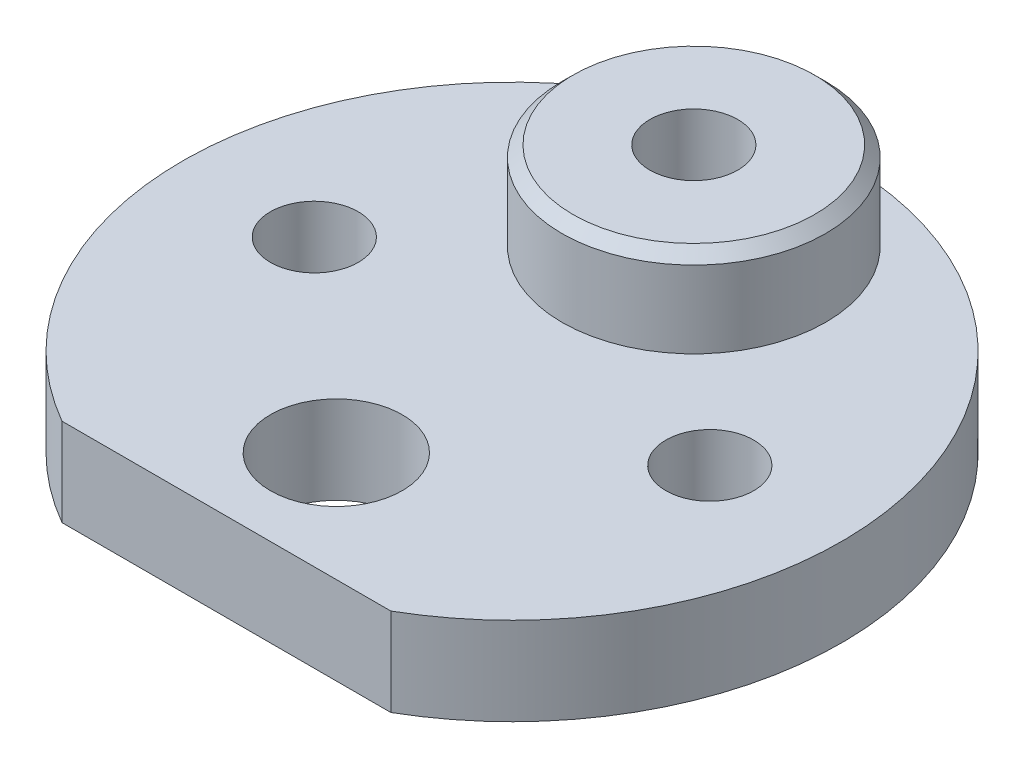
ISO-10303-21;
HEADER;
FILE_DESCRIPTION(('STEP AP214'),'2;1');
FILE_NAME('part.step','',(''),(''),'','','');
FILE_SCHEMA(('AUTOMOTIVE_DESIGN { 1 0 10303 214 1 1 1 1 }'));
ENDSEC;
DATA;
#1=APPLICATION_CONTEXT('core data for automotive mechanical design processes');
#2=APPLICATION_PROTOCOL_DEFINITION('international standard','automotive_design',2000,#1);
#3=PRODUCT_CONTEXT('',#1,'mechanical');
#4=PRODUCT('Part','Part','',(#3));
#5=PRODUCT_RELATED_PRODUCT_CATEGORY('part','',(#4));
#6=PRODUCT_DEFINITION_FORMATION('','',#4);
#7=PRODUCT_DEFINITION_CONTEXT('part definition',#1,'design');
#8=PRODUCT_DEFINITION('design','',#6,#7);
#9=PRODUCT_DEFINITION_SHAPE('','',#8);
#10=(LENGTH_UNIT() NAMED_UNIT(*) SI_UNIT(.MILLI.,.METRE.));
#11=(NAMED_UNIT(*) PLANE_ANGLE_UNIT() SI_UNIT($,.RADIAN.));
#12=(NAMED_UNIT(*) SI_UNIT($,.STERADIAN.) SOLID_ANGLE_UNIT());
#13=UNCERTAINTY_MEASURE_WITH_UNIT(LENGTH_MEASURE(1.E-05),#10,'distance_accuracy_value','');
#14=(GEOMETRIC_REPRESENTATION_CONTEXT(3) GLOBAL_UNCERTAINTY_ASSIGNED_CONTEXT((#13)) GLOBAL_UNIT_ASSIGNED_CONTEXT((#10,
#11,#12)) REPRESENTATION_CONTEXT('',''));
#15=CARTESIAN_POINT('',(0.,0.,0.));
#16=DIRECTION('',(0.,0.,1.));
#17=DIRECTION('',(1.,0.,0.));
#18=AXIS2_PLACEMENT_3D('',#15,#16,#17);
#19=CARTESIAN_POINT('',(0.,4.,0.));
#20=DIRECTION('',(0.,1.,0.));
#21=DIRECTION('',(0.,0.,1.));
#22=AXIS2_PLACEMENT_3D('',#19,#20,#21);
#23=PLANE('',#22);
#24=CARTESIAN_POINT('',(0.,4.,-8.27291861355965));
#25=DIRECTION('',(0.,1.,0.));
#26=DIRECTION('',(0.,0.,1.));
#27=AXIS2_PLACEMENT_3D('',#24,#25,#26);
#28=CIRCLE('',#27,6.);
#29=CARTESIAN_POINT('',(0.,4.,-2.27291861355965));
#30=VERTEX_POINT('',#29);
#31=EDGE_CURVE('E196',#30,#30,#28,.T.);
#32=ORIENTED_EDGE('',*,*,#31,.F.);
#33=EDGE_LOOP('',(#32));
#34=FACE_BOUND('',#33,.T.);
#35=CARTESIAN_POINT('',(-9.,4.,0.));
#36=DIRECTION('',(0.,1.,0.));
#37=DIRECTION('',(0.,0.,1.));
#38=AXIS2_PLACEMENT_3D('',#35,#36,#37);
#39=CIRCLE('',#38,2.);
#40=CARTESIAN_POINT('',(-9.,4.,2.));
#41=VERTEX_POINT('',#40);
#42=EDGE_CURVE('E211',#41,#41,#39,.T.);
#43=ORIENTED_EDGE('',*,*,#42,.F.);
#44=EDGE_LOOP('',(#43));
#45=FACE_BOUND('',#44,.T.);
#46=CARTESIAN_POINT('',(0.,4.,0.));
#47=DIRECTION('',(0.,1.,0.));
#48=DIRECTION('',(0.,0.,1.));
#49=AXIS2_PLACEMENT_3D('',#46,#47,#48);
#50=CIRCLE('',#49,15.);
#51=CARTESIAN_POINT('',(7.48331477354788,4.,13.));
#52=VERTEX_POINT('',#51);
#53=CARTESIAN_POINT('',(-7.48331477354788,4.,13.));
#54=VERTEX_POINT('',#53);
#55=EDGE_CURVE('E70',#52,#54,#50,.T.);
#56=ORIENTED_EDGE('',*,*,#55,.T.);
#57=DIRECTION('',(1.,0.,0.));
#58=VECTOR('',#57,1.);
#59=CARTESIAN_POINT('',(-7.48331477354788,4.,13.));
#60=LINE('',#59,#58);
#61=EDGE_CURVE('E52',#54,#52,#60,.T.);
#62=ORIENTED_EDGE('',*,*,#61,.T.);
#63=EDGE_LOOP('',(#56,#62));
#64=FACE_BOUND('',#63,.T.);
#65=CARTESIAN_POINT('',(0.,4.,8.));
#66=DIRECTION('',(0.,1.,0.));
#67=DIRECTION('',(0.,0.,1.));
#68=AXIS2_PLACEMENT_3D('',#65,#66,#67);
#69=CIRCLE('',#68,3.);
#70=CARTESIAN_POINT('',(0.,4.,11.));
#71=VERTEX_POINT('',#70);
#72=EDGE_CURVE('E78',#71,#71,#69,.T.);
#73=ORIENTED_EDGE('',*,*,#72,.F.);
#74=EDGE_LOOP('',(#73));
#75=FACE_BOUND('',#74,.T.);
#76=CARTESIAN_POINT('',(9.,4.,0.));
#77=DIRECTION('',(0.,1.,0.));
#78=DIRECTION('',(0.,0.,1.));
#79=AXIS2_PLACEMENT_3D('',#76,#77,#78);
#80=CIRCLE('',#79,2.);
#81=CARTESIAN_POINT('',(9.,4.,2.));
#82=VERTEX_POINT('',#81);
#83=EDGE_CURVE('E201',#82,#82,#80,.T.);
#84=ORIENTED_EDGE('',*,*,#83,.F.);
#85=EDGE_LOOP('',(#84));
#86=FACE_BOUND('',#85,.T.);
#87=ADVANCED_FACE('F35',(#34,#45,#64,#75,#86),#23,.T.);
#88=CARTESIAN_POINT('',(0.,0.,0.));
#89=DIRECTION('',(0.,1.,0.));
#90=DIRECTION('',(0.,0.,1.));
#91=AXIS2_PLACEMENT_3D('',#88,#89,#90);
#92=PLANE('',#91);
#93=CARTESIAN_POINT('',(0.,0.,-8.27291861355965));
#94=DIRECTION('',(0.,1.,0.));
#95=DIRECTION('',(0.,0.,1.));
#96=AXIS2_PLACEMENT_3D('',#93,#94,#95);
#97=CIRCLE('',#96,2.);
#98=CARTESIAN_POINT('',(0.,0.,-6.27291861355965));
#99=VERTEX_POINT('',#98);
#100=EDGE_CURVE('E198',#99,#99,#97,.T.);
#101=ORIENTED_EDGE('',*,*,#100,.T.);
#102=EDGE_LOOP('',(#101));
#103=FACE_BOUND('',#102,.T.);
#104=CARTESIAN_POINT('',(0.,0.,0.));
#105=DIRECTION('',(0.,1.,0.));
#106=DIRECTION('',(0.,0.,1.));
#107=AXIS2_PLACEMENT_3D('',#104,#105,#106);
#108=CIRCLE('',#107,15.);
#109=CARTESIAN_POINT('',(7.48331477354788,0.,13.));
#110=VERTEX_POINT('',#109);
#111=CARTESIAN_POINT('',(-7.48331477354788,0.,13.));
#112=VERTEX_POINT('',#111);
#113=EDGE_CURVE('E71',#110,#112,#108,.T.);
#114=ORIENTED_EDGE('',*,*,#113,.F.);
#115=DIRECTION('',(1.,0.,0.));
#116=VECTOR('',#115,1.);
#117=CARTESIAN_POINT('',(-7.48331477354788,0.,13.));
#118=LINE('',#117,#116);
#119=EDGE_CURVE('E60',#112,#110,#118,.T.);
#120=ORIENTED_EDGE('',*,*,#119,.F.);
#121=EDGE_LOOP('',(#114,#120));
#122=FACE_BOUND('',#121,.T.);
#123=CARTESIAN_POINT('',(0.,0.,8.));
#124=DIRECTION('',(0.,1.,0.));
#125=DIRECTION('',(0.,0.,1.));
#126=AXIS2_PLACEMENT_3D('',#123,#124,#125);
#127=CIRCLE('',#126,3.);
#128=CARTESIAN_POINT('',(0.,0.,11.));
#129=VERTEX_POINT('',#128);
#130=EDGE_CURVE('E81',#129,#129,#127,.T.);
#131=ORIENTED_EDGE('',*,*,#130,.T.);
#132=EDGE_LOOP('',(#131));
#133=FACE_BOUND('',#132,.T.);
#134=CARTESIAN_POINT('',(-9.,0.,0.));
#135=DIRECTION('',(0.,1.,0.));
#136=DIRECTION('',(0.,0.,1.));
#137=AXIS2_PLACEMENT_3D('',#134,#135,#136);
#138=CIRCLE('',#137,2.);
#139=CARTESIAN_POINT('',(-9.,0.,2.));
#140=VERTEX_POINT('',#139);
#141=EDGE_CURVE('E209',#140,#140,#138,.T.);
#142=ORIENTED_EDGE('',*,*,#141,.T.);
#143=EDGE_LOOP('',(#142));
#144=FACE_BOUND('',#143,.T.);
#145=CARTESIAN_POINT('',(9.,0.,0.));
#146=DIRECTION('',(0.,1.,0.));
#147=DIRECTION('',(0.,0.,1.));
#148=AXIS2_PLACEMENT_3D('',#145,#146,#147);
#149=CIRCLE('',#148,2.);
#150=CARTESIAN_POINT('',(9.,0.,2.));
#151=VERTEX_POINT('',#150);
#152=EDGE_CURVE('E197',#151,#151,#149,.T.);
#153=ORIENTED_EDGE('',*,*,#152,.T.);
#154=EDGE_LOOP('',(#153));
#155=FACE_BOUND('',#154,.T.);
#156=ADVANCED_FACE('F76',(#103,#122,#133,#144,#155),#92,.F.);
#157=CARTESIAN_POINT('',(0.,4.,0.));
#158=DIRECTION('',(0.,-1.,0.));
#159=DIRECTION('',(0.,0.,-1.));
#160=AXIS2_PLACEMENT_3D('',#157,#158,#159);
#161=CYLINDRICAL_SURFACE('',#160,15.);
#162=ORIENTED_EDGE('',*,*,#113,.T.);
#163=DIRECTION('',(0.,-1.,0.));
#164=VECTOR('',#163,1.);
#165=CARTESIAN_POINT('',(-7.48331477354788,4.,13.));
#166=LINE('',#165,#164);
#167=EDGE_CURVE('E68',#54,#112,#166,.T.);
#168=ORIENTED_EDGE('',*,*,#167,.F.);
#169=ORIENTED_EDGE('',*,*,#55,.F.);
#170=DIRECTION('',(0.,-1.,0.));
#171=VECTOR('',#170,1.);
#172=CARTESIAN_POINT('',(7.48331477354788,4.,13.));
#173=LINE('',#172,#171);
#174=EDGE_CURVE('E65',#52,#110,#173,.T.);
#175=ORIENTED_EDGE('',*,*,#174,.T.);
#176=EDGE_LOOP('',(#162,#168,#169,#175));
#177=FACE_BOUND('',#176,.T.);
#178=ADVANCED_FACE('F74',(#177),#161,.T.);
#179=CARTESIAN_POINT('',(-7.48331477354788,4.,13.));
#180=DIRECTION('',(0.,0.,-1.));
#181=DIRECTION('',(-1.,0.,0.));
#182=AXIS2_PLACEMENT_3D('',#179,#180,#181);
#183=PLANE('',#182);
#184=ORIENTED_EDGE('',*,*,#119,.T.);
#185=ORIENTED_EDGE('',*,*,#174,.F.);
#186=ORIENTED_EDGE('',*,*,#61,.F.);
#187=ORIENTED_EDGE('',*,*,#167,.T.);
#188=EDGE_LOOP('',(#184,#185,#186,#187));
#189=FACE_BOUND('',#188,.T.);
#190=ADVANCED_FACE('F64',(#189),#183,.F.);
#191=CARTESIAN_POINT('',(0.,4.,8.));
#192=DIRECTION('',(0.,-1.,0.));
#193=DIRECTION('',(0.,0.,-1.));
#194=AXIS2_PLACEMENT_3D('',#191,#192,#193);
#195=CYLINDRICAL_SURFACE('',#194,3.);
#196=ORIENTED_EDGE('',*,*,#72,.T.);
#197=EDGE_LOOP('',(#196));
#198=FACE_BOUND('',#197,.T.);
#199=ORIENTED_EDGE('',*,*,#130,.F.);
#200=EDGE_LOOP('',(#199));
#201=FACE_BOUND('',#200,.T.);
#202=ADVANCED_FACE('F112',(#198,#201),#195,.F.);
#203=CARTESIAN_POINT('',(-9.,4.,0.));
#204=DIRECTION('',(0.,-1.,0.));
#205=DIRECTION('',(0.,0.,-1.));
#206=AXIS2_PLACEMENT_3D('',#203,#204,#205);
#207=CYLINDRICAL_SURFACE('',#206,2.);
#208=ORIENTED_EDGE('',*,*,#42,.T.);
#209=EDGE_LOOP('',(#208));
#210=FACE_BOUND('',#209,.T.);
#211=ORIENTED_EDGE('',*,*,#141,.F.);
#212=EDGE_LOOP('',(#211));
#213=FACE_BOUND('',#212,.T.);
#214=ADVANCED_FACE('F131',(#210,#213),#207,.F.);
#215=CARTESIAN_POINT('',(9.,4.,0.));
#216=DIRECTION('',(0.,-1.,0.));
#217=DIRECTION('',(0.,0.,-1.));
#218=AXIS2_PLACEMENT_3D('',#215,#216,#217);
#219=CYLINDRICAL_SURFACE('',#218,2.);
#220=ORIENTED_EDGE('',*,*,#83,.T.);
#221=EDGE_LOOP('',(#220));
#222=FACE_BOUND('',#221,.T.);
#223=ORIENTED_EDGE('',*,*,#152,.F.);
#224=EDGE_LOOP('',(#223));
#225=FACE_BOUND('',#224,.T.);
#226=ADVANCED_FACE('F138',(#222,#225),#219,.F.);
#227=CARTESIAN_POINT('',(0.,8.,-8.27291861355965));
#228=DIRECTION('',(0.,-1.,0.));
#229=DIRECTION('',(0.,0.,-1.));
#230=AXIS2_PLACEMENT_3D('',#227,#228,#229);
#231=CYLINDRICAL_SURFACE('',#230,6.);
#232=CARTESIAN_POINT('',(0.,7.5,-8.27291861355965));
#233=DIRECTION('',(0.,1.,0.));
#234=DIRECTION('',(0.,0.,1.));
#235=AXIS2_PLACEMENT_3D('',#232,#233,#234);
#236=CIRCLE('',#235,6.);
#237=CARTESIAN_POINT('',(0.,7.5,-2.27291861355965));
#238=VERTEX_POINT('',#237);
#239=EDGE_CURVE('E11',#238,#238,#236,.F.);
#240=ORIENTED_EDGE('',*,*,#239,.T.);
#241=EDGE_LOOP('',(#240));
#242=FACE_BOUND('',#241,.T.);
#243=ORIENTED_EDGE('',*,*,#31,.T.);
#244=EDGE_LOOP('',(#243));
#245=FACE_BOUND('',#244,.T.);
#246=ADVANCED_FACE('F145',(#242,#245),#231,.T.);
#247=CARTESIAN_POINT('',(0.,8.,-8.27291861355965));
#248=DIRECTION('',(0.,1.,0.));
#249=DIRECTION('',(0.,0.,1.));
#250=AXIS2_PLACEMENT_3D('',#247,#248,#249);
#251=PLANE('',#250);
#252=CARTESIAN_POINT('',(0.,8.,-8.27291861355965));
#253=DIRECTION('',(0.,1.,0.));
#254=DIRECTION('',(0.,0.,1.));
#255=AXIS2_PLACEMENT_3D('',#252,#253,#254);
#256=CIRCLE('',#255,5.5);
#257=CARTESIAN_POINT('',(0.,8.,-2.77291861355965));
#258=VERTEX_POINT('',#257);
#259=EDGE_CURVE('E45',#258,#258,#256,.T.);
#260=ORIENTED_EDGE('',*,*,#259,.T.);
#261=EDGE_LOOP('',(#260));
#262=FACE_BOUND('',#261,.T.);
#263=CARTESIAN_POINT('',(0.,8.,-8.27291861355965));
#264=DIRECTION('',(0.,1.,0.));
#265=DIRECTION('',(0.,0.,1.));
#266=AXIS2_PLACEMENT_3D('',#263,#264,#265);
#267=CIRCLE('',#266,2.);
#268=CARTESIAN_POINT('',(0.,8.,-6.27291861355965));
#269=VERTEX_POINT('',#268);
#270=EDGE_CURVE('E204',#269,#269,#267,.T.);
#271=ORIENTED_EDGE('',*,*,#270,.F.);
#272=EDGE_LOOP('',(#271));
#273=FACE_BOUND('',#272,.T.);
#274=ADVANCED_FACE('F89',(#262,#273),#251,.T.);
#275=CARTESIAN_POINT('',(0.,-7.,-8.27291861355965));
#276=DIRECTION('',(0.,1.,0.));
#277=DIRECTION('',(0.,0.,1.));
#278=AXIS2_PLACEMENT_3D('',#275,#276,#277);
#279=CYLINDRICAL_SURFACE('',#278,2.);
#280=ORIENTED_EDGE('',*,*,#270,.T.);
#281=EDGE_LOOP('',(#280));
#282=FACE_BOUND('',#281,.T.);
#283=ORIENTED_EDGE('',*,*,#100,.F.);
#284=EDGE_LOOP('',(#283));
#285=FACE_BOUND('',#284,.T.);
#286=ADVANCED_FACE('F93',(#282,#285),#279,.F.);
#287=CARTESIAN_POINT('',(0.,8.,-8.27291861355965));
#288=DIRECTION('',(0.,-1.,0.));
#289=DIRECTION('',(0.,0.,-1.));
#290=AXIS2_PLACEMENT_3D('',#287,#288,#289);
#291=CONICAL_SURFACE('',#290,5.5,0.785398163397449);
#292=ORIENTED_EDGE('',*,*,#239,.F.);
#293=EDGE_LOOP('',(#292));
#294=FACE_BOUND('',#293,.T.);
#295=ORIENTED_EDGE('',*,*,#259,.F.);
#296=EDGE_LOOP('',(#295));
#297=FACE_BOUND('',#296,.T.);
#298=ADVANCED_FACE('F38',(#294,#297),#291,.T.);
#299=CLOSED_SHELL('',(#87,#156,#178,#190,#202,#214,#226,#246,#274,#286,#298));
#300=MANIFOLD_SOLID_BREP('B2',#299);
#301=ADVANCED_BREP_SHAPE_REPRESENTATION('',(#18,#300),#14);
#302=SHAPE_DEFINITION_REPRESENTATION(#9,#301);
ENDSEC;
END-ISO-10303-21;
